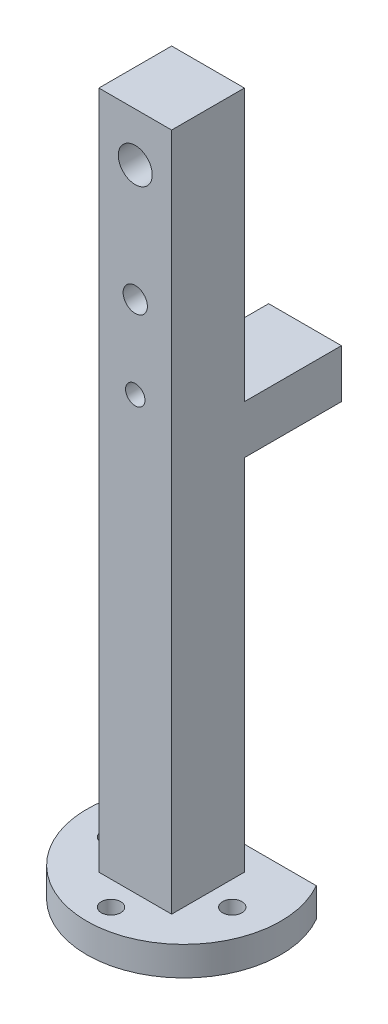
ISO-10303-21;
HEADER;
FILE_DESCRIPTION(('STEP AP214'),'2;1');
FILE_NAME('part.step','',(''),(''),'','','');
FILE_SCHEMA(('AUTOMOTIVE_DESIGN { 1 0 10303 214 1 1 1 1 }'));
ENDSEC;
DATA;
#1=APPLICATION_CONTEXT('core data for automotive mechanical design processes');
#2=APPLICATION_PROTOCOL_DEFINITION('international standard','automotive_design',2000,#1);
#3=PRODUCT_CONTEXT('',#1,'mechanical');
#4=PRODUCT('Part','Part','',(#3));
#5=PRODUCT_RELATED_PRODUCT_CATEGORY('part','',(#4));
#6=PRODUCT_DEFINITION_FORMATION('','',#4);
#7=PRODUCT_DEFINITION_CONTEXT('part definition',#1,'design');
#8=PRODUCT_DEFINITION('design','',#6,#7);
#9=PRODUCT_DEFINITION_SHAPE('','',#8);
#10=(LENGTH_UNIT() NAMED_UNIT(*) SI_UNIT(.MILLI.,.METRE.));
#11=(NAMED_UNIT(*) PLANE_ANGLE_UNIT() SI_UNIT($,.RADIAN.));
#12=(NAMED_UNIT(*) SI_UNIT($,.STERADIAN.) SOLID_ANGLE_UNIT());
#13=UNCERTAINTY_MEASURE_WITH_UNIT(LENGTH_MEASURE(1.E-05),#10,'distance_accuracy_value','');
#14=(GEOMETRIC_REPRESENTATION_CONTEXT(3) GLOBAL_UNCERTAINTY_ASSIGNED_CONTEXT((#13)) GLOBAL_UNIT_ASSIGNED_CONTEXT((#10,
#11,#12)) REPRESENTATION_CONTEXT('',''));
#15=CARTESIAN_POINT('',(0.,0.,0.));
#16=DIRECTION('',(0.,0.,1.));
#17=DIRECTION('',(1.,0.,0.));
#18=AXIS2_PLACEMENT_3D('',#15,#16,#17);
#19=CARTESIAN_POINT('',(0.,177.8,-19.05));
#20=DIRECTION('',(0.,0.,1.));
#21=DIRECTION('',(1.,0.,0.));
#22=AXIS2_PLACEMENT_3D('',#19,#20,#21);
#23=PLANE('',#22);
#24=DIRECTION('',(-1.,0.,0.));
#25=VECTOR('',#24,1.);
#26=CARTESIAN_POINT('',(19.05,93.98,-19.05));
#27=LINE('',#26,#25);
#28=CARTESIAN_POINT('',(19.05,93.98,-19.05));
#29=VERTEX_POINT('',#28);
#30=CARTESIAN_POINT('',(0.,93.98,-19.05));
#31=VERTEX_POINT('',#30);
#32=EDGE_CURVE('E49',#29,#31,#27,.T.);
#33=ORIENTED_EDGE('',*,*,#32,.F.);
#34=DIRECTION('',(0.,-1.,0.));
#35=VECTOR('',#34,1.);
#36=CARTESIAN_POINT('',(19.05,177.8,-19.05));
#37=LINE('',#36,#35);
#38=CARTESIAN_POINT('',(19.05,0.,-19.05));
#39=VERTEX_POINT('',#38);
#40=EDGE_CURVE('E132',#29,#39,#37,.T.);
#41=ORIENTED_EDGE('',*,*,#40,.T.);
#42=DIRECTION('',(-1.,0.,0.));
#43=VECTOR('',#42,1.);
#44=CARTESIAN_POINT('',(0.,0.,-19.05));
#45=LINE('',#44,#43);
#46=CARTESIAN_POINT('',(0.,0.,-19.05));
#47=VERTEX_POINT('',#46);
#48=EDGE_CURVE('E195',#39,#47,#45,.T.);
#49=ORIENTED_EDGE('',*,*,#48,.T.);
#50=DIRECTION('',(0.,-1.,0.));
#51=VECTOR('',#50,1.);
#52=CARTESIAN_POINT('',(0.,177.8,-19.05));
#53=LINE('',#52,#51);
#54=EDGE_CURVE('E54',#31,#47,#53,.T.);
#55=ORIENTED_EDGE('',*,*,#54,.F.);
#56=EDGE_LOOP('',(#33,#41,#49,#55));
#57=FACE_BOUND('',#56,.T.);
#58=ADVANCED_FACE('F34',(#57),#23,.F.);
#59=CARTESIAN_POINT('',(9.525,165.1,-19.05));
#60=DIRECTION('',(0.,0.,-1.));
#61=DIRECTION('',(-1.,0.,0.));
#62=AXIS2_PLACEMENT_3D('',#59,#60,#61);
#63=CIRCLE('',#62,4.445);
#64=CARTESIAN_POINT('',(5.08,165.1,-19.05));
#65=VERTEX_POINT('',#64);
#66=EDGE_CURVE('E150',#65,#65,#63,.T.);
#67=ORIENTED_EDGE('',*,*,#66,.F.);
#68=EDGE_LOOP('',(#67));
#69=FACE_BOUND('',#68,.T.);
#70=CARTESIAN_POINT('',(9.525,113.03,-19.05));
#71=DIRECTION('',(0.,0.,-1.));
#72=DIRECTION('',(-1.,0.,0.));
#73=AXIS2_PLACEMENT_3D('',#70,#71,#72);
#74=CIRCLE('',#73,2.54);
#75=CARTESIAN_POINT('',(6.985,113.03,-19.05));
#76=VERTEX_POINT('',#75);
#77=EDGE_CURVE('E133',#76,#76,#74,.T.);
#78=ORIENTED_EDGE('',*,*,#77,.F.);
#79=EDGE_LOOP('',(#78));
#80=FACE_BOUND('',#79,.T.);
#81=CARTESIAN_POINT('',(9.525,134.62,-19.05));
#82=DIRECTION('',(0.,0.,-1.));
#83=DIRECTION('',(-1.,0.,0.));
#84=AXIS2_PLACEMENT_3D('',#81,#82,#83);
#85=CIRCLE('',#84,3.175);
#86=CARTESIAN_POINT('',(6.35,134.62,-19.05));
#87=VERTEX_POINT('',#86);
#88=EDGE_CURVE('E136',#87,#87,#85,.T.);
#89=ORIENTED_EDGE('',*,*,#88,.F.);
#90=EDGE_LOOP('',(#89));
#91=FACE_BOUND('',#90,.T.);
#92=DIRECTION('',(1.,0.,0.));
#93=VECTOR('',#92,1.);
#94=CARTESIAN_POINT('',(19.05,106.68,-19.05));
#95=LINE('',#94,#93);
#96=CARTESIAN_POINT('',(0.,106.68,-19.05));
#97=VERTEX_POINT('',#96);
#98=CARTESIAN_POINT('',(19.05,106.68,-19.05));
#99=VERTEX_POINT('',#98);
#100=EDGE_CURVE('E128',#97,#99,#95,.T.);
#101=ORIENTED_EDGE('',*,*,#100,.F.);
#102=CARTESIAN_POINT('',(0.,177.8,-19.05));
#103=VERTEX_POINT('',#102);
#104=EDGE_CURVE('E209',#103,#97,#53,.T.);
#105=ORIENTED_EDGE('',*,*,#104,.F.);
#106=DIRECTION('',(-1.,0.,0.));
#107=VECTOR('',#106,1.);
#108=CARTESIAN_POINT('',(0.,177.8,-19.05));
#109=LINE('',#108,#107);
#110=CARTESIAN_POINT('',(19.05,177.8,-19.05));
#111=VERTEX_POINT('',#110);
#112=EDGE_CURVE('E199',#111,#103,#109,.T.);
#113=ORIENTED_EDGE('',*,*,#112,.F.);
#114=EDGE_CURVE('E212',#111,#99,#37,.T.);
#115=ORIENTED_EDGE('',*,*,#114,.T.);
#116=EDGE_LOOP('',(#101,#105,#113,#115));
#117=FACE_BOUND('',#116,.T.);
#118=ADVANCED_FACE('F226',(#69,#80,#91,#117),#23,.F.);
#119=CARTESIAN_POINT('',(0.,177.8,-19.05));
#120=DIRECTION('',(1.,0.,0.));
#121=DIRECTION('',(0.,0.,-1.));
#122=AXIS2_PLACEMENT_3D('',#119,#120,#121);
#123=PLANE('',#122);
#124=DIRECTION('',(0.,0.,1.));
#125=VECTOR('',#124,1.);
#126=CARTESIAN_POINT('',(0.,0.,-19.05));
#127=LINE('',#126,#125);
#128=CARTESIAN_POINT('',(0.,0.,0.));
#129=VERTEX_POINT('',#128);
#130=EDGE_CURVE('E190',#47,#129,#127,.T.);
#131=ORIENTED_EDGE('',*,*,#130,.T.);
#132=DIRECTION('',(0.,-1.,0.));
#133=VECTOR('',#132,1.);
#134=CARTESIAN_POINT('',(0.,177.8,0.));
#135=LINE('',#134,#133);
#136=CARTESIAN_POINT('',(0.,177.8,0.));
#137=VERTEX_POINT('',#136);
#138=EDGE_CURVE('E11',#137,#129,#135,.T.);
#139=ORIENTED_EDGE('',*,*,#138,.F.);
#140=DIRECTION('',(0.,0.,1.));
#141=VECTOR('',#140,1.);
#142=CARTESIAN_POINT('',(0.,177.8,-19.05));
#143=LINE('',#142,#141);
#144=EDGE_CURVE('E191',#103,#137,#143,.T.);
#145=ORIENTED_EDGE('',*,*,#144,.F.);
#146=ORIENTED_EDGE('',*,*,#104,.T.);
#147=DIRECTION('',(0.,0.,1.));
#148=VECTOR('',#147,1.);
#149=CARTESIAN_POINT('',(0.,106.68,-44.45));
#150=LINE('',#149,#148);
#151=CARTESIAN_POINT('',(0.,106.68,-44.45));
#152=VERTEX_POINT('',#151);
#153=EDGE_CURVE('E138',#152,#97,#150,.T.);
#154=ORIENTED_EDGE('',*,*,#153,.F.);
#155=DIRECTION('',(0.,1.,0.));
#156=VECTOR('',#155,1.);
#157=CARTESIAN_POINT('',(0.,106.68,-44.45));
#158=LINE('',#157,#156);
#159=CARTESIAN_POINT('',(0.,93.98,-44.45));
#160=VERTEX_POINT('',#159);
#161=EDGE_CURVE('E118',#160,#152,#158,.T.);
#162=ORIENTED_EDGE('',*,*,#161,.F.);
#163=DIRECTION('',(0.,0.,1.));
#164=VECTOR('',#163,1.);
#165=CARTESIAN_POINT('',(0.,93.98,-44.45));
#166=LINE('',#165,#164);
#167=EDGE_CURVE('E115',#160,#31,#166,.T.);
#168=ORIENTED_EDGE('',*,*,#167,.T.);
#169=ORIENTED_EDGE('',*,*,#54,.T.);
#170=EDGE_LOOP('',(#131,#139,#145,#146,#154,#162,#168,#169));
#171=FACE_BOUND('',#170,.T.);
#172=ADVANCED_FACE('F36',(#171),#123,.F.);
#173=CARTESIAN_POINT('',(0.,177.8,0.));
#174=DIRECTION('',(0.,0.,-1.));
#175=DIRECTION('',(-1.,0.,0.));
#176=AXIS2_PLACEMENT_3D('',#173,#174,#175);
#177=PLANE('',#176);
#178=CARTESIAN_POINT('',(9.525,134.62,0.));
#179=DIRECTION('',(0.,0.,-1.));
#180=DIRECTION('',(-1.,0.,0.));
#181=AXIS2_PLACEMENT_3D('',#178,#179,#180);
#182=CIRCLE('',#181,3.175);
#183=CARTESIAN_POINT('',(6.35,134.62,0.));
#184=VERTEX_POINT('',#183);
#185=EDGE_CURVE('E147',#184,#184,#182,.T.);
#186=ORIENTED_EDGE('',*,*,#185,.T.);
#187=EDGE_LOOP('',(#186));
#188=FACE_BOUND('',#187,.T.);
#189=CARTESIAN_POINT('',(9.525,113.03,0.));
#190=DIRECTION('',(0.,0.,-1.));
#191=DIRECTION('',(-1.,0.,0.));
#192=AXIS2_PLACEMENT_3D('',#189,#190,#191);
#193=CIRCLE('',#192,2.54);
#194=CARTESIAN_POINT('',(6.985,113.03,0.));
#195=VERTEX_POINT('',#194);
#196=EDGE_CURVE('E143',#195,#195,#193,.T.);
#197=ORIENTED_EDGE('',*,*,#196,.T.);
#198=EDGE_LOOP('',(#197));
#199=FACE_BOUND('',#198,.T.);
#200=CARTESIAN_POINT('',(9.525,165.1,0.));
#201=DIRECTION('',(0.,0.,-1.));
#202=DIRECTION('',(-1.,0.,0.));
#203=AXIS2_PLACEMENT_3D('',#200,#201,#202);
#204=CIRCLE('',#203,4.445);
#205=CARTESIAN_POINT('',(5.08,165.1,0.));
#206=VERTEX_POINT('',#205);
#207=EDGE_CURVE('E151',#206,#206,#204,.T.);
#208=ORIENTED_EDGE('',*,*,#207,.T.);
#209=EDGE_LOOP('',(#208));
#210=FACE_BOUND('',#209,.T.);
#211=DIRECTION('',(1.,0.,0.));
#212=VECTOR('',#211,1.);
#213=CARTESIAN_POINT('',(0.,0.,0.));
#214=LINE('',#213,#212);
#215=CARTESIAN_POINT('',(19.05,0.,0.));
#216=VERTEX_POINT('',#215);
#217=EDGE_CURVE('E203',#129,#216,#214,.T.);
#218=ORIENTED_EDGE('',*,*,#217,.T.);
#219=DIRECTION('',(0.,-1.,0.));
#220=VECTOR('',#219,1.);
#221=CARTESIAN_POINT('',(19.05,177.8,0.));
#222=LINE('',#221,#220);
#223=CARTESIAN_POINT('',(19.05,177.8,0.));
#224=VERTEX_POINT('',#223);
#225=EDGE_CURVE('E42',#224,#216,#222,.T.);
#226=ORIENTED_EDGE('',*,*,#225,.F.);
#227=DIRECTION('',(1.,0.,0.));
#228=VECTOR('',#227,1.);
#229=CARTESIAN_POINT('',(0.,177.8,0.));
#230=LINE('',#229,#228);
#231=EDGE_CURVE('E194',#137,#224,#230,.T.);
#232=ORIENTED_EDGE('',*,*,#231,.F.);
#233=ORIENTED_EDGE('',*,*,#138,.T.);
#234=EDGE_LOOP('',(#218,#226,#232,#233));
#235=FACE_BOUND('',#234,.T.);
#236=ADVANCED_FACE('F218',(#188,#199,#210,#235),#177,.F.);
#237=CARTESIAN_POINT('',(19.05,177.8,-19.05));
#238=DIRECTION('',(-1.,0.,0.));
#239=DIRECTION('',(0.,0.,1.));
#240=AXIS2_PLACEMENT_3D('',#237,#238,#239);
#241=PLANE('',#240);
#242=DIRECTION('',(0.,0.,-1.));
#243=VECTOR('',#242,1.);
#244=CARTESIAN_POINT('',(19.05,0.,-19.05));
#245=LINE('',#244,#243);
#246=EDGE_CURVE('E206',#216,#39,#245,.T.);
#247=ORIENTED_EDGE('',*,*,#246,.T.);
#248=ORIENTED_EDGE('',*,*,#40,.F.);
#249=DIRECTION('',(0.,0.,1.));
#250=VECTOR('',#249,1.);
#251=CARTESIAN_POINT('',(19.05,93.98,-44.45));
#252=LINE('',#251,#250);
#253=CARTESIAN_POINT('',(19.05,93.98,-44.45));
#254=VERTEX_POINT('',#253);
#255=EDGE_CURVE('E113',#254,#29,#252,.T.);
#256=ORIENTED_EDGE('',*,*,#255,.F.);
#257=DIRECTION('',(0.,-1.,0.));
#258=VECTOR('',#257,1.);
#259=CARTESIAN_POINT('',(19.05,106.68,-44.45));
#260=LINE('',#259,#258);
#261=CARTESIAN_POINT('',(19.05,106.68,-44.45));
#262=VERTEX_POINT('',#261);
#263=EDGE_CURVE('E119',#262,#254,#260,.T.);
#264=ORIENTED_EDGE('',*,*,#263,.F.);
#265=DIRECTION('',(0.,0.,1.));
#266=VECTOR('',#265,1.);
#267=CARTESIAN_POINT('',(19.05,106.68,-44.45));
#268=LINE('',#267,#266);
#269=EDGE_CURVE('E270',#262,#99,#268,.T.);
#270=ORIENTED_EDGE('',*,*,#269,.T.);
#271=ORIENTED_EDGE('',*,*,#114,.F.);
#272=DIRECTION('',(0.,0.,-1.));
#273=VECTOR('',#272,1.);
#274=CARTESIAN_POINT('',(19.05,177.8,-19.05));
#275=LINE('',#274,#273);
#276=EDGE_CURVE('E197',#224,#111,#275,.T.);
#277=ORIENTED_EDGE('',*,*,#276,.F.);
#278=ORIENTED_EDGE('',*,*,#225,.T.);
#279=EDGE_LOOP('',(#247,#248,#256,#264,#270,#271,#277,#278));
#280=FACE_BOUND('',#279,.T.);
#281=ADVANCED_FACE('F131',(#280),#241,.F.);
#282=CARTESIAN_POINT('',(0.,177.8,0.));
#283=DIRECTION('',(0.,1.,0.));
#284=DIRECTION('',(0.,0.,1.));
#285=AXIS2_PLACEMENT_3D('',#282,#283,#284);
#286=PLANE('',#285);
#287=ORIENTED_EDGE('',*,*,#144,.T.);
#288=ORIENTED_EDGE('',*,*,#231,.T.);
#289=ORIENTED_EDGE('',*,*,#276,.T.);
#290=ORIENTED_EDGE('',*,*,#112,.T.);
#291=EDGE_LOOP('',(#287,#288,#289,#290));
#292=FACE_BOUND('',#291,.T.);
#293=ADVANCED_FACE('F234',(#292),#286,.T.);
#294=CARTESIAN_POINT('',(0.,-7.62,-25.4));
#295=DIRECTION('',(0.,0.,1.));
#296=DIRECTION('',(1.,0.,0.));
#297=AXIS2_PLACEMENT_3D('',#294,#295,#296);
#298=PLANE('',#297);
#299=DIRECTION('',(1.,0.,0.));
#300=VECTOR('',#299,1.);
#301=CARTESIAN_POINT('',(0.,0.,-25.4));
#302=LINE('',#301,#300);
#303=CARTESIAN_POINT('',(-12.4720452561247,0.,-25.4));
#304=VERTEX_POINT('',#303);
#305=CARTESIAN_POINT('',(31.5220452561247,0.,-25.4));
#306=VERTEX_POINT('',#305);
#307=EDGE_CURVE('E160',#304,#306,#302,.T.);
#308=ORIENTED_EDGE('',*,*,#307,.T.);
#309=DIRECTION('',(0.,1.,0.));
#310=VECTOR('',#309,1.);
#311=CARTESIAN_POINT('',(31.5220452561247,-7.62,-25.4));
#312=LINE('',#311,#310);
#313=CARTESIAN_POINT('',(31.5220452561247,-7.62,-25.4));
#314=VERTEX_POINT('',#313);
#315=EDGE_CURVE('E187',#314,#306,#312,.T.);
#316=ORIENTED_EDGE('',*,*,#315,.F.);
#317=DIRECTION('',(1.,0.,0.));
#318=VECTOR('',#317,1.);
#319=CARTESIAN_POINT('',(0.,-7.62,-25.4));
#320=LINE('',#319,#318);
#321=CARTESIAN_POINT('',(-12.4720452561247,-7.62,-25.4));
#322=VERTEX_POINT('',#321);
#323=EDGE_CURVE('E175',#322,#314,#320,.T.);
#324=ORIENTED_EDGE('',*,*,#323,.F.);
#325=DIRECTION('',(0.,1.,0.));
#326=VECTOR('',#325,1.);
#327=CARTESIAN_POINT('',(-12.4720452561247,-7.62,-25.4));
#328=LINE('',#327,#326);
#329=EDGE_CURVE('E181',#322,#304,#328,.T.);
#330=ORIENTED_EDGE('',*,*,#329,.T.);
#331=EDGE_LOOP('',(#308,#316,#324,#330));
#332=FACE_BOUND('',#331,.T.);
#333=ADVANCED_FACE('F277',(#332),#298,.F.);
#334=CARTESIAN_POINT('',(9.525,-7.62,-12.7));
#335=DIRECTION('',(0.,1.,0.));
#336=DIRECTION('',(0.,0.,1.));
#337=AXIS2_PLACEMENT_3D('',#334,#335,#336);
#338=CYLINDRICAL_SURFACE('',#337,25.4);
#339=CARTESIAN_POINT('',(9.525,0.,-12.7));
#340=DIRECTION('',(0.,-1.,0.));
#341=DIRECTION('',(0.,0.,-1.));
#342=AXIS2_PLACEMENT_3D('',#339,#340,#341);
#343=CIRCLE('',#342,25.4);
#344=EDGE_CURVE('E179',#306,#304,#343,.T.);
#345=ORIENTED_EDGE('',*,*,#344,.T.);
#346=ORIENTED_EDGE('',*,*,#329,.F.);
#347=CARTESIAN_POINT('',(9.525,-7.62,-12.7));
#348=DIRECTION('',(0.,-1.,0.));
#349=DIRECTION('',(0.,0.,-1.));
#350=AXIS2_PLACEMENT_3D('',#347,#348,#349);
#351=CIRCLE('',#350,25.4);
#352=EDGE_CURVE('E178',#314,#322,#351,.T.);
#353=ORIENTED_EDGE('',*,*,#352,.F.);
#354=ORIENTED_EDGE('',*,*,#315,.T.);
#355=EDGE_LOOP('',(#345,#346,#353,#354));
#356=FACE_BOUND('',#355,.T.);
#357=ADVANCED_FACE('F281',(#356),#338,.T.);
#358=CARTESIAN_POINT('',(0.,-7.62,0.));
#359=DIRECTION('',(0.,-1.,0.));
#360=DIRECTION('',(0.,0.,-1.));
#361=AXIS2_PLACEMENT_3D('',#358,#359,#360);
#362=PLANE('',#361);
#363=CARTESIAN_POINT('',(-6.35,-7.62,-9.525));
#364=DIRECTION('',(0.,1.,0.));
#365=DIRECTION('',(0.,0.,1.));
#366=AXIS2_PLACEMENT_3D('',#363,#364,#365);
#367=CIRCLE('',#366,2.54);
#368=CARTESIAN_POINT('',(-6.35,-7.62,-6.985));
#369=VERTEX_POINT('',#368);
#370=EDGE_CURVE('E157',#369,#369,#367,.T.);
#371=ORIENTED_EDGE('',*,*,#370,.T.);
#372=EDGE_LOOP('',(#371));
#373=FACE_BOUND('',#372,.T.);
#374=CARTESIAN_POINT('',(25.4,-7.62,-9.525));
#375=DIRECTION('',(0.,1.,0.));
#376=DIRECTION('',(0.,0.,1.));
#377=AXIS2_PLACEMENT_3D('',#374,#375,#376);
#378=CIRCLE('',#377,2.54);
#379=CARTESIAN_POINT('',(25.4,-7.62,-6.985));
#380=VERTEX_POINT('',#379);
#381=EDGE_CURVE('E164',#380,#380,#378,.T.);
#382=ORIENTED_EDGE('',*,*,#381,.T.);
#383=EDGE_LOOP('',(#382));
#384=FACE_BOUND('',#383,.T.);
#385=CARTESIAN_POINT('',(9.525,-7.62,6.35));
#386=DIRECTION('',(0.,1.,0.));
#387=DIRECTION('',(0.,0.,1.));
#388=AXIS2_PLACEMENT_3D('',#385,#386,#387);
#389=CIRCLE('',#388,2.54);
#390=CARTESIAN_POINT('',(9.525,-7.62,8.89));
#391=VERTEX_POINT('',#390);
#392=EDGE_CURVE('E170',#391,#391,#389,.T.);
#393=ORIENTED_EDGE('',*,*,#392,.T.);
#394=EDGE_LOOP('',(#393));
#395=FACE_BOUND('',#394,.T.);
#396=ORIENTED_EDGE('',*,*,#323,.T.);
#397=ORIENTED_EDGE('',*,*,#352,.T.);
#398=EDGE_LOOP('',(#396,#397));
#399=FACE_BOUND('',#398,.T.);
#400=ADVANCED_FACE('F286',(#373,#384,#395,#399),#362,.T.);
#401=CARTESIAN_POINT('',(0.,0.,0.));
#402=DIRECTION('',(0.,-1.,0.));
#403=DIRECTION('',(0.,0.,-1.));
#404=AXIS2_PLACEMENT_3D('',#401,#402,#403);
#405=PLANE('',#404);
#406=CARTESIAN_POINT('',(-6.35,0.,-9.525));
#407=DIRECTION('',(0.,1.,0.));
#408=DIRECTION('',(0.,0.,1.));
#409=AXIS2_PLACEMENT_3D('',#406,#407,#408);
#410=CIRCLE('',#409,2.54);
#411=CARTESIAN_POINT('',(-6.35,0.,-6.985));
#412=VERTEX_POINT('',#411);
#413=EDGE_CURVE('E161',#412,#412,#410,.T.);
#414=ORIENTED_EDGE('',*,*,#413,.F.);
#415=EDGE_LOOP('',(#414));
#416=FACE_BOUND('',#415,.T.);
#417=CARTESIAN_POINT('',(25.4,0.,-9.525));
#418=DIRECTION('',(0.,1.,0.));
#419=DIRECTION('',(0.,0.,1.));
#420=AXIS2_PLACEMENT_3D('',#417,#418,#419);
#421=CIRCLE('',#420,2.54);
#422=CARTESIAN_POINT('',(25.4,0.,-6.985));
#423=VERTEX_POINT('',#422);
#424=EDGE_CURVE('E167',#423,#423,#421,.T.);
#425=ORIENTED_EDGE('',*,*,#424,.F.);
#426=EDGE_LOOP('',(#425));
#427=FACE_BOUND('',#426,.T.);
#428=CARTESIAN_POINT('',(9.525,0.,6.35));
#429=DIRECTION('',(0.,1.,0.));
#430=DIRECTION('',(0.,0.,1.));
#431=AXIS2_PLACEMENT_3D('',#428,#429,#430);
#432=CIRCLE('',#431,2.54);
#433=CARTESIAN_POINT('',(9.525,0.,8.89));
#434=VERTEX_POINT('',#433);
#435=EDGE_CURVE('E154',#434,#434,#432,.T.);
#436=ORIENTED_EDGE('',*,*,#435,.F.);
#437=EDGE_LOOP('',(#436));
#438=FACE_BOUND('',#437,.T.);
#439=ORIENTED_EDGE('',*,*,#130,.F.);
#440=ORIENTED_EDGE('',*,*,#48,.F.);
#441=ORIENTED_EDGE('',*,*,#246,.F.);
#442=ORIENTED_EDGE('',*,*,#217,.F.);
#443=EDGE_LOOP('',(#439,#440,#441,#442));
#444=FACE_BOUND('',#443,.T.);
#445=ORIENTED_EDGE('',*,*,#307,.F.);
#446=ORIENTED_EDGE('',*,*,#344,.F.);
#447=EDGE_LOOP('',(#445,#446));
#448=FACE_BOUND('',#447,.T.);
#449=ADVANCED_FACE('F222',(#416,#427,#438,#444,#448),#405,.F.);
#450=CARTESIAN_POINT('',(9.525,-7.62,6.35));
#451=DIRECTION('',(0.,1.,0.));
#452=DIRECTION('',(0.,0.,1.));
#453=AXIS2_PLACEMENT_3D('',#450,#451,#452);
#454=CYLINDRICAL_SURFACE('',#453,2.54);
#455=ORIENTED_EDGE('',*,*,#392,.F.);
#456=EDGE_LOOP('',(#455));
#457=FACE_BOUND('',#456,.T.);
#458=ORIENTED_EDGE('',*,*,#435,.T.);
#459=EDGE_LOOP('',(#458));
#460=FACE_BOUND('',#459,.T.);
#461=ADVANCED_FACE('F292',(#457,#460),#454,.F.);
#462=CARTESIAN_POINT('',(25.4,-7.62,-9.525));
#463=DIRECTION('',(0.,1.,0.));
#464=DIRECTION('',(0.,0.,1.));
#465=AXIS2_PLACEMENT_3D('',#462,#463,#464);
#466=CYLINDRICAL_SURFACE('',#465,2.54);
#467=ORIENTED_EDGE('',*,*,#381,.F.);
#468=EDGE_LOOP('',(#467));
#469=FACE_BOUND('',#468,.T.);
#470=ORIENTED_EDGE('',*,*,#424,.T.);
#471=EDGE_LOOP('',(#470));
#472=FACE_BOUND('',#471,.T.);
#473=ADVANCED_FACE('F299',(#469,#472),#466,.F.);
#474=CARTESIAN_POINT('',(-6.35,-7.62,-9.525));
#475=DIRECTION('',(0.,1.,0.));
#476=DIRECTION('',(0.,0.,1.));
#477=AXIS2_PLACEMENT_3D('',#474,#475,#476);
#478=CYLINDRICAL_SURFACE('',#477,2.54);
#479=ORIENTED_EDGE('',*,*,#370,.F.);
#480=EDGE_LOOP('',(#479));
#481=FACE_BOUND('',#480,.T.);
#482=ORIENTED_EDGE('',*,*,#413,.T.);
#483=EDGE_LOOP('',(#482));
#484=FACE_BOUND('',#483,.T.);
#485=ADVANCED_FACE('F253',(#481,#484),#478,.F.);
#486=CARTESIAN_POINT('',(9.525,165.1,0.));
#487=DIRECTION('',(0.,0.,-1.));
#488=DIRECTION('',(-1.,0.,0.));
#489=AXIS2_PLACEMENT_3D('',#486,#487,#488);
#490=CYLINDRICAL_SURFACE('',#489,4.445);
#491=ORIENTED_EDGE('',*,*,#207,.F.);
#492=EDGE_LOOP('',(#491));
#493=FACE_BOUND('',#492,.T.);
#494=ORIENTED_EDGE('',*,*,#66,.T.);
#495=EDGE_LOOP('',(#494));
#496=FACE_BOUND('',#495,.T.);
#497=ADVANCED_FACE('F249',(#493,#496),#490,.F.);
#498=CARTESIAN_POINT('',(9.525,113.03,19.05));
#499=DIRECTION('',(0.,0.,-1.));
#500=DIRECTION('',(-1.,0.,0.));
#501=AXIS2_PLACEMENT_3D('',#498,#499,#500);
#502=CYLINDRICAL_SURFACE('',#501,2.54);
#503=ORIENTED_EDGE('',*,*,#77,.T.);
#504=EDGE_LOOP('',(#503));
#505=FACE_BOUND('',#504,.T.);
#506=ORIENTED_EDGE('',*,*,#196,.F.);
#507=EDGE_LOOP('',(#506));
#508=FACE_BOUND('',#507,.T.);
#509=ADVANCED_FACE('F252',(#505,#508),#502,.F.);
#510=CARTESIAN_POINT('',(9.525,134.62,19.05));
#511=DIRECTION('',(0.,0.,-1.));
#512=DIRECTION('',(-1.,0.,0.));
#513=AXIS2_PLACEMENT_3D('',#510,#511,#512);
#514=CYLINDRICAL_SURFACE('',#513,3.175);
#515=ORIENTED_EDGE('',*,*,#88,.T.);
#516=EDGE_LOOP('',(#515));
#517=FACE_BOUND('',#516,.T.);
#518=ORIENTED_EDGE('',*,*,#185,.F.);
#519=EDGE_LOOP('',(#518));
#520=FACE_BOUND('',#519,.T.);
#521=ADVANCED_FACE('F309',(#517,#520),#514,.F.);
#522=CARTESIAN_POINT('',(19.05,93.98,-44.45));
#523=DIRECTION('',(0.,1.,0.));
#524=DIRECTION('',(0.,0.,1.));
#525=AXIS2_PLACEMENT_3D('',#522,#523,#524);
#526=PLANE('',#525);
#527=ORIENTED_EDGE('',*,*,#32,.T.);
#528=ORIENTED_EDGE('',*,*,#167,.F.);
#529=DIRECTION('',(-1.,0.,0.));
#530=VECTOR('',#529,1.);
#531=CARTESIAN_POINT('',(19.05,93.98,-44.45));
#532=LINE('',#531,#530);
#533=EDGE_CURVE('E109',#254,#160,#532,.T.);
#534=ORIENTED_EDGE('',*,*,#533,.F.);
#535=ORIENTED_EDGE('',*,*,#255,.T.);
#536=EDGE_LOOP('',(#527,#528,#534,#535));
#537=FACE_BOUND('',#536,.T.);
#538=ADVANCED_FACE('F111',(#537),#526,.F.);
#539=CARTESIAN_POINT('',(19.05,106.68,-44.45));
#540=DIRECTION('',(0.,-1.,0.));
#541=DIRECTION('',(0.,0.,-1.));
#542=AXIS2_PLACEMENT_3D('',#539,#540,#541);
#543=PLANE('',#542);
#544=ORIENTED_EDGE('',*,*,#100,.T.);
#545=ORIENTED_EDGE('',*,*,#269,.F.);
#546=DIRECTION('',(1.,0.,0.));
#547=VECTOR('',#546,1.);
#548=CARTESIAN_POINT('',(19.05,106.68,-44.45));
#549=LINE('',#548,#547);
#550=EDGE_CURVE('E124',#152,#262,#549,.T.);
#551=ORIENTED_EDGE('',*,*,#550,.F.);
#552=ORIENTED_EDGE('',*,*,#153,.T.);
#553=EDGE_LOOP('',(#544,#545,#551,#552));
#554=FACE_BOUND('',#553,.T.);
#555=ADVANCED_FACE('F269',(#554),#543,.F.);
#556=CARTESIAN_POINT('',(0.,0.,-44.45));
#557=DIRECTION('',(0.,0.,-1.));
#558=DIRECTION('',(-1.,0.,0.));
#559=AXIS2_PLACEMENT_3D('',#556,#557,#558);
#560=PLANE('',#559);
#561=ORIENTED_EDGE('',*,*,#263,.T.);
#562=ORIENTED_EDGE('',*,*,#533,.T.);
#563=ORIENTED_EDGE('',*,*,#161,.T.);
#564=ORIENTED_EDGE('',*,*,#550,.T.);
#565=EDGE_LOOP('',(#561,#562,#563,#564));
#566=FACE_BOUND('',#565,.T.);
#567=ADVANCED_FACE('F122',(#566),#560,.T.);
#568=CLOSED_SHELL('',(#58,#118,#172,#236,#281,#293,#333,#357,#400,#449,#461,#473,#485,#497,#509,
#521,#538,#555,#567));
#569=MANIFOLD_SOLID_BREP('B2',#568);
#570=ADVANCED_BREP_SHAPE_REPRESENTATION('',(#18,#569),#14);
#571=SHAPE_DEFINITION_REPRESENTATION(#9,#570);
ENDSEC;
END-ISO-10303-21;
